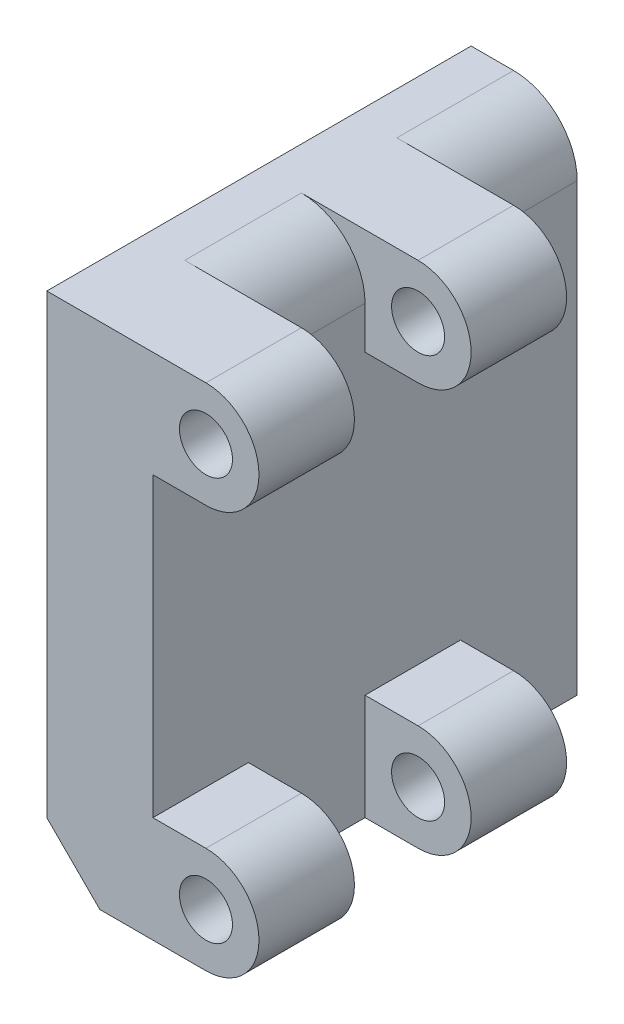
ISO-10303-21;
HEADER;
FILE_DESCRIPTION(('STEP AP214'),'2;1');
FILE_NAME('part.step','',(''),(''),'','','');
FILE_SCHEMA(('AUTOMOTIVE_DESIGN { 1 0 10303 214 1 1 1 1 }'));
ENDSEC;
DATA;
#1=APPLICATION_CONTEXT('core data for automotive mechanical design processes');
#2=APPLICATION_PROTOCOL_DEFINITION('international standard','automotive_design',2000,#1);
#3=PRODUCT_CONTEXT('',#1,'mechanical');
#4=PRODUCT('Part','Part','',(#3));
#5=PRODUCT_RELATED_PRODUCT_CATEGORY('part','',(#4));
#6=PRODUCT_DEFINITION_FORMATION('','',#4);
#7=PRODUCT_DEFINITION_CONTEXT('part definition',#1,'design');
#8=PRODUCT_DEFINITION('design','',#6,#7);
#9=PRODUCT_DEFINITION_SHAPE('','',#8);
#10=(LENGTH_UNIT() NAMED_UNIT(*) SI_UNIT(.MILLI.,.METRE.));
#11=(NAMED_UNIT(*) PLANE_ANGLE_UNIT() SI_UNIT($,.RADIAN.));
#12=(NAMED_UNIT(*) SI_UNIT($,.STERADIAN.) SOLID_ANGLE_UNIT());
#13=UNCERTAINTY_MEASURE_WITH_UNIT(LENGTH_MEASURE(1.E-05),#10,'distance_accuracy_value','');
#14=(GEOMETRIC_REPRESENTATION_CONTEXT(3) GLOBAL_UNCERTAINTY_ASSIGNED_CONTEXT((#13)) GLOBAL_UNIT_ASSIGNED_CONTEXT((#10,
#11,#12)) REPRESENTATION_CONTEXT('',''));
#15=CARTESIAN_POINT('',(0.,0.,0.));
#16=DIRECTION('',(0.,0.,1.));
#17=DIRECTION('',(1.,0.,0.));
#18=AXIS2_PLACEMENT_3D('',#15,#16,#17);
#19=CARTESIAN_POINT('',(10.,0.,0.));
#20=DIRECTION('',(-1.,0.,0.));
#21=DIRECTION('',(0.,0.,1.));
#22=AXIS2_PLACEMENT_3D('',#19,#20,#21);
#23=PLANE('',#22);
#24=DIRECTION('',(0.,1.,0.));
#25=VECTOR('',#24,1.);
#26=CARTESIAN_POINT('',(10.,-24.,-20.));
#27=LINE('',#26,#25);
#28=CARTESIAN_POINT('',(10.,-24.,-20.));
#29=VERTEX_POINT('',#28);
#30=CARTESIAN_POINT('',(10.,18.,-20.));
#31=VERTEX_POINT('',#30);
#32=EDGE_CURVE('E359',#29,#31,#27,.T.);
#33=ORIENTED_EDGE('',*,*,#32,.T.);
#34=DIRECTION('',(0.,0.,1.));
#35=VECTOR('',#34,1.);
#36=CARTESIAN_POINT('',(10.,18.,0.));
#37=LINE('',#36,#35);
#38=CARTESIAN_POINT('',(10.,18.,-9.));
#39=VERTEX_POINT('',#38);
#40=EDGE_CURVE('E411',#31,#39,#37,.T.);
#41=ORIENTED_EDGE('',*,*,#40,.T.);
#42=DIRECTION('',(0.,1.,0.));
#43=VECTOR('',#42,1.);
#44=CARTESIAN_POINT('',(10.,0.,-9.));
#45=LINE('',#44,#43);
#46=CARTESIAN_POINT('',(10.,14.,-9.));
#47=VERTEX_POINT('',#46);
#48=EDGE_CURVE('E279',#47,#39,#45,.T.);
#49=ORIENTED_EDGE('',*,*,#48,.F.);
#50=DIRECTION('',(0.,0.,1.));
#51=VECTOR('',#50,1.);
#52=CARTESIAN_POINT('',(10.,14.,0.));
#53=LINE('',#52,#51);
#54=CARTESIAN_POINT('',(10.,14.,0.));
#55=VERTEX_POINT('',#54);
#56=EDGE_CURVE('E399',#47,#55,#53,.T.);
#57=ORIENTED_EDGE('',*,*,#56,.T.);
#58=DIRECTION('',(0.,1.,0.));
#59=VECTOR('',#58,1.);
#60=CARTESIAN_POINT('',(10.,0.,0.));
#61=LINE('',#60,#59);
#62=CARTESIAN_POINT('',(10.,18.,0.));
#63=VERTEX_POINT('',#62);
#64=EDGE_CURVE('E272',#55,#63,#61,.T.);
#65=ORIENTED_EDGE('',*,*,#64,.T.);
#66=DIRECTION('',(0.,0.,1.));
#67=VECTOR('',#66,1.);
#68=CARTESIAN_POINT('',(10.,18.,0.));
#69=LINE('',#68,#67);
#70=CARTESIAN_POINT('',(10.,18.,11.));
#71=VERTEX_POINT('',#70);
#72=EDGE_CURVE('E407',#63,#71,#69,.T.);
#73=ORIENTED_EDGE('',*,*,#72,.T.);
#74=DIRECTION('',(0.,1.,0.));
#75=VECTOR('',#74,1.);
#76=CARTESIAN_POINT('',(10.,0.,11.));
#77=LINE('',#76,#75);
#78=CARTESIAN_POINT('',(10.,14.,11.));
#79=VERTEX_POINT('',#78);
#80=EDGE_CURVE('E351',#79,#71,#77,.T.);
#81=ORIENTED_EDGE('',*,*,#80,.F.);
#82=DIRECTION('',(0.,0.,1.));
#83=VECTOR('',#82,1.);
#84=CARTESIAN_POINT('',(10.,14.,0.));
#85=LINE('',#84,#83);
#86=CARTESIAN_POINT('',(10.,14.,20.));
#87=VERTEX_POINT('',#86);
#88=EDGE_CURVE('E392',#79,#87,#85,.T.);
#89=ORIENTED_EDGE('',*,*,#88,.T.);
#90=DIRECTION('',(0.,-1.,0.));
#91=VECTOR('',#90,1.);
#92=CARTESIAN_POINT('',(10.,-24.,20.));
#93=LINE('',#92,#91);
#94=CARTESIAN_POINT('',(10.,-14.,20.));
#95=VERTEX_POINT('',#94);
#96=EDGE_CURVE('E363',#87,#95,#93,.T.);
#97=ORIENTED_EDGE('',*,*,#96,.T.);
#98=DIRECTION('',(0.,0.,-1.));
#99=VECTOR('',#98,1.);
#100=CARTESIAN_POINT('',(10.,-14.,0.));
#101=LINE('',#100,#99);
#102=CARTESIAN_POINT('',(10.,-14.,11.));
#103=VERTEX_POINT('',#102);
#104=EDGE_CURVE('E396',#95,#103,#101,.T.);
#105=ORIENTED_EDGE('',*,*,#104,.T.);
#106=DIRECTION('',(0.,1.,0.));
#107=VECTOR('',#106,1.);
#108=CARTESIAN_POINT('',(10.,0.,11.));
#109=LINE('',#108,#107);
#110=CARTESIAN_POINT('',(10.,-24.,11.));
#111=VERTEX_POINT('',#110);
#112=EDGE_CURVE('E314',#111,#103,#109,.T.);
#113=ORIENTED_EDGE('',*,*,#112,.F.);
#114=DIRECTION('',(0.,0.,-1.));
#115=VECTOR('',#114,1.);
#116=CARTESIAN_POINT('',(10.,-24.,20.));
#117=LINE('',#116,#115);
#118=CARTESIAN_POINT('',(10.,-24.,0.));
#119=VERTEX_POINT('',#118);
#120=EDGE_CURVE('E367',#111,#119,#117,.T.);
#121=ORIENTED_EDGE('',*,*,#120,.T.);
#122=DIRECTION('',(0.,1.,0.));
#123=VECTOR('',#122,1.);
#124=CARTESIAN_POINT('',(10.,0.,0.));
#125=LINE('',#124,#123);
#126=CARTESIAN_POINT('',(10.,-14.,0.));
#127=VERTEX_POINT('',#126);
#128=EDGE_CURVE('E232',#119,#127,#125,.T.);
#129=ORIENTED_EDGE('',*,*,#128,.T.);
#130=DIRECTION('',(0.,0.,-1.));
#131=VECTOR('',#130,1.);
#132=CARTESIAN_POINT('',(10.,-14.,0.));
#133=LINE('',#132,#131);
#134=CARTESIAN_POINT('',(10.,-14.,-9.));
#135=VERTEX_POINT('',#134);
#136=EDGE_CURVE('E403',#127,#135,#133,.T.);
#137=ORIENTED_EDGE('',*,*,#136,.T.);
#138=DIRECTION('',(0.,1.,0.));
#139=VECTOR('',#138,1.);
#140=CARTESIAN_POINT('',(10.,0.,-9.));
#141=LINE('',#140,#139);
#142=CARTESIAN_POINT('',(10.,-24.,-9.));
#143=VERTEX_POINT('',#142);
#144=EDGE_CURVE('E237',#143,#135,#141,.T.);
#145=ORIENTED_EDGE('',*,*,#144,.F.);
#146=EDGE_CURVE('E197',#143,#29,#117,.T.);
#147=ORIENTED_EDGE('',*,*,#146,.T.);
#148=EDGE_LOOP('',(#33,#41,#49,#57,#65,#73,#81,#89,#97,#105,#113,#121,#129,#137,#145,#147));
#149=FACE_BOUND('',#148,.T.);
#150=ADVANCED_FACE('F45',(#149),#23,.F.);
#151=CARTESIAN_POINT('',(10.,-24.,-20.));
#152=DIRECTION('',(0.,0.,1.));
#153=DIRECTION('',(1.,0.,0.));
#154=AXIS2_PLACEMENT_3D('',#151,#152,#153);
#155=PLANE('',#154);
#156=DIRECTION('',(-1.,0.,0.));
#157=VECTOR('',#156,1.);
#158=CARTESIAN_POINT('',(10.,-24.,-20.));
#159=LINE('',#158,#157);
#160=CARTESIAN_POINT('',(5.,-24.,-20.));
#161=VERTEX_POINT('',#160);
#162=EDGE_CURVE('E371',#29,#161,#159,.T.);
#163=ORIENTED_EDGE('',*,*,#162,.T.);
#164=DIRECTION('',(-0.707106781186547,0.707106781186548,0.));
#165=VECTOR('',#164,1.);
#166=CARTESIAN_POINT('',(5.,-24.,-20.));
#167=LINE('',#166,#165);
#168=CARTESIAN_POINT('',(0.,-19.,-20.));
#169=VERTEX_POINT('',#168);
#170=EDGE_CURVE('E69',#161,#169,#167,.T.);
#171=ORIENTED_EDGE('',*,*,#170,.T.);
#172=DIRECTION('',(0.,1.,0.));
#173=VECTOR('',#172,1.);
#174=CARTESIAN_POINT('',(0.,-24.,-20.));
#175=LINE('',#174,#173);
#176=CARTESIAN_POINT('',(0.,24.,-20.));
#177=VERTEX_POINT('',#176);
#178=EDGE_CURVE('E358',#169,#177,#175,.T.);
#179=ORIENTED_EDGE('',*,*,#178,.T.);
#180=DIRECTION('',(-1.,0.,0.));
#181=VECTOR('',#180,1.);
#182=CARTESIAN_POINT('',(10.,24.,-20.));
#183=LINE('',#182,#181);
#184=CARTESIAN_POINT('',(4.,24.,-20.));
#185=VERTEX_POINT('',#184);
#186=EDGE_CURVE('E388',#185,#177,#183,.T.);
#187=ORIENTED_EDGE('',*,*,#186,.F.);
#188=CARTESIAN_POINT('',(4.,18.,-20.));
#189=DIRECTION('',(0.,0.,1.));
#190=DIRECTION('',(1.,0.,0.));
#191=AXIS2_PLACEMENT_3D('',#188,#189,#190);
#192=CIRCLE('',#191,6.);
#193=EDGE_CURVE('E422',#185,#31,#192,.F.);
#194=ORIENTED_EDGE('',*,*,#193,.T.);
#195=ORIENTED_EDGE('',*,*,#32,.F.);
#196=EDGE_LOOP('',(#163,#171,#179,#187,#194,#195));
#197=FACE_BOUND('',#196,.T.);
#198=ADVANCED_FACE('F447',(#197),#155,.F.);
#199=CARTESIAN_POINT('',(10.,24.,20.));
#200=DIRECTION('',(0.,-1.,0.));
#201=DIRECTION('',(0.,0.,-1.));
#202=AXIS2_PLACEMENT_3D('',#199,#200,#201);
#203=PLANE('',#202);
#204=DIRECTION('',(-1.,0.,0.));
#205=VECTOR('',#204,1.);
#206=CARTESIAN_POINT('',(5.,24.,-9.));
#207=LINE('',#206,#205);
#208=CARTESIAN_POINT('',(15.,24.,-9.));
#209=VERTEX_POINT('',#208);
#210=CARTESIAN_POINT('',(4.,24.,-9.));
#211=VERTEX_POINT('',#210);
#212=EDGE_CURVE('E257',#209,#211,#207,.T.);
#213=ORIENTED_EDGE('',*,*,#212,.T.);
#214=DIRECTION('',(0.,0.,1.));
#215=VECTOR('',#214,1.);
#216=CARTESIAN_POINT('',(4.,24.,20.));
#217=LINE('',#216,#215);
#218=EDGE_CURVE('E419',#211,#185,#217,.F.);
#219=ORIENTED_EDGE('',*,*,#218,.T.);
#220=ORIENTED_EDGE('',*,*,#186,.T.);
#221=DIRECTION('',(0.,0.,1.));
#222=VECTOR('',#221,1.);
#223=CARTESIAN_POINT('',(0.,24.,20.));
#224=LINE('',#223,#222);
#225=CARTESIAN_POINT('',(0.,24.,20.));
#226=VERTEX_POINT('',#225);
#227=EDGE_CURVE('E374',#177,#226,#224,.T.);
#228=ORIENTED_EDGE('',*,*,#227,.T.);
#229=DIRECTION('',(-1.,0.,0.));
#230=VECTOR('',#229,1.);
#231=CARTESIAN_POINT('',(10.,24.,20.));
#232=LINE('',#231,#230);
#233=CARTESIAN_POINT('',(15.,24.,20.));
#234=VERTEX_POINT('',#233);
#235=EDGE_CURVE('E385',#234,#226,#232,.T.);
#236=ORIENTED_EDGE('',*,*,#235,.F.);
#237=DIRECTION('',(0.,0.,1.));
#238=VECTOR('',#237,1.);
#239=CARTESIAN_POINT('',(15.,24.,11.));
#240=LINE('',#239,#238);
#241=CARTESIAN_POINT('',(15.,24.,11.));
#242=VERTEX_POINT('',#241);
#243=EDGE_CURVE('E347',#242,#234,#240,.T.);
#244=ORIENTED_EDGE('',*,*,#243,.F.);
#245=DIRECTION('',(-1.,0.,0.));
#246=VECTOR('',#245,1.);
#247=CARTESIAN_POINT('',(5.,24.,11.));
#248=LINE('',#247,#246);
#249=CARTESIAN_POINT('',(4.,24.,11.));
#250=VERTEX_POINT('',#249);
#251=EDGE_CURVE('E338',#242,#250,#248,.T.);
#252=ORIENTED_EDGE('',*,*,#251,.T.);
#253=DIRECTION('',(0.,0.,1.));
#254=VECTOR('',#253,1.);
#255=CARTESIAN_POINT('',(4.,24.,20.));
#256=LINE('',#255,#254);
#257=CARTESIAN_POINT('',(4.,24.,0.));
#258=VERTEX_POINT('',#257);
#259=EDGE_CURVE('E415',#250,#258,#256,.F.);
#260=ORIENTED_EDGE('',*,*,#259,.T.);
#261=DIRECTION('',(-1.,0.,0.));
#262=VECTOR('',#261,1.);
#263=CARTESIAN_POINT('',(5.,24.,0.));
#264=LINE('',#263,#262);
#265=CARTESIAN_POINT('',(15.,24.,0.));
#266=VERTEX_POINT('',#265);
#267=EDGE_CURVE('E253',#266,#258,#264,.T.);
#268=ORIENTED_EDGE('',*,*,#267,.F.);
#269=DIRECTION('',(0.,0.,1.));
#270=VECTOR('',#269,1.);
#271=CARTESIAN_POINT('',(15.,24.,-9.));
#272=LINE('',#271,#270);
#273=EDGE_CURVE('E269',#209,#266,#272,.T.);
#274=ORIENTED_EDGE('',*,*,#273,.F.);
#275=EDGE_LOOP('',(#213,#219,#220,#228,#236,#244,#252,#260,#268,#274));
#276=FACE_BOUND('',#275,.T.);
#277=ADVANCED_FACE('F470',(#276),#203,.F.);
#278=CARTESIAN_POINT('',(10.,-24.,20.));
#279=DIRECTION('',(0.,0.,-1.));
#280=DIRECTION('',(-1.,0.,0.));
#281=AXIS2_PLACEMENT_3D('',#278,#279,#280);
#282=PLANE('',#281);
#283=DIRECTION('',(0.,-1.,0.));
#284=VECTOR('',#283,1.);
#285=CARTESIAN_POINT('',(0.,-24.,20.));
#286=LINE('',#285,#284);
#287=CARTESIAN_POINT('',(0.,-19.,20.));
#288=VERTEX_POINT('',#287);
#289=EDGE_CURVE('E364',#226,#288,#286,.T.);
#290=ORIENTED_EDGE('',*,*,#289,.T.);
#291=DIRECTION('',(0.707106781186547,-0.707106781186548,0.));
#292=VECTOR('',#291,1.);
#293=CARTESIAN_POINT('',(5.,-24.,20.));
#294=LINE('',#293,#292);
#295=CARTESIAN_POINT('',(5.,-24.,20.));
#296=VERTEX_POINT('',#295);
#297=EDGE_CURVE('E11',#288,#296,#294,.T.);
#298=ORIENTED_EDGE('',*,*,#297,.T.);
#299=DIRECTION('',(-1.,0.,0.));
#300=VECTOR('',#299,1.);
#301=CARTESIAN_POINT('',(10.,-24.,20.));
#302=LINE('',#301,#300);
#303=CARTESIAN_POINT('',(15.,-24.,20.));
#304=VERTEX_POINT('',#303);
#305=EDGE_CURVE('E382',#304,#296,#302,.T.);
#306=ORIENTED_EDGE('',*,*,#305,.F.);
#307=CARTESIAN_POINT('',(15.,-19.,20.));
#308=DIRECTION('',(0.,0.,1.));
#309=DIRECTION('',(1.,0.,0.));
#310=AXIS2_PLACEMENT_3D('',#307,#308,#309);
#311=CIRCLE('',#310,5.);
#312=CARTESIAN_POINT('',(15.,-14.,20.));
#313=VERTEX_POINT('',#312);
#314=EDGE_CURVE('E295',#304,#313,#311,.T.);
#315=ORIENTED_EDGE('',*,*,#314,.T.);
#316=DIRECTION('',(-1.,0.,0.));
#317=VECTOR('',#316,1.);
#318=CARTESIAN_POINT('',(5.,-14.,20.));
#319=LINE('',#318,#317);
#320=EDGE_CURVE('E291',#313,#95,#319,.T.);
#321=ORIENTED_EDGE('',*,*,#320,.T.);
#322=ORIENTED_EDGE('',*,*,#96,.F.);
#323=DIRECTION('',(1.,0.,0.));
#324=VECTOR('',#323,1.);
#325=CARTESIAN_POINT('',(5.,14.,20.));
#326=LINE('',#325,#324);
#327=CARTESIAN_POINT('',(15.,14.,20.));
#328=VERTEX_POINT('',#327);
#329=EDGE_CURVE('E326',#87,#328,#326,.T.);
#330=ORIENTED_EDGE('',*,*,#329,.T.);
#331=CARTESIAN_POINT('',(15.,19.,20.));
#332=DIRECTION('',(0.,0.,1.));
#333=DIRECTION('',(1.,0.,0.));
#334=AXIS2_PLACEMENT_3D('',#331,#332,#333);
#335=CIRCLE('',#334,5.);
#336=EDGE_CURVE('E334',#328,#234,#335,.T.);
#337=ORIENTED_EDGE('',*,*,#336,.T.);
#338=ORIENTED_EDGE('',*,*,#235,.T.);
#339=EDGE_LOOP('',(#290,#298,#306,#315,#321,#322,#330,#337,#338));
#340=FACE_BOUND('',#339,.T.);
#341=CARTESIAN_POINT('',(15.,19.,20.));
#342=DIRECTION('',(0.,0.,1.));
#343=DIRECTION('',(1.,0.,0.));
#344=AXIS2_PLACEMENT_3D('',#341,#342,#343);
#345=CIRCLE('',#344,2.5);
#346=CARTESIAN_POINT('',(17.5,19.,20.));
#347=VERTEX_POINT('',#346);
#348=EDGE_CURVE('E321',#347,#347,#345,.T.);
#349=ORIENTED_EDGE('',*,*,#348,.F.);
#350=EDGE_LOOP('',(#349));
#351=FACE_BOUND('',#350,.T.);
#352=CARTESIAN_POINT('',(15.,-19.,20.));
#353=DIRECTION('',(0.,0.,1.));
#354=DIRECTION('',(1.,0.,0.));
#355=AXIS2_PLACEMENT_3D('',#352,#353,#354);
#356=CIRCLE('',#355,2.5);
#357=CARTESIAN_POINT('',(17.5,-19.,20.));
#358=VERTEX_POINT('',#357);
#359=EDGE_CURVE('E310',#358,#358,#356,.T.);
#360=ORIENTED_EDGE('',*,*,#359,.F.);
#361=EDGE_LOOP('',(#360));
#362=FACE_BOUND('',#361,.T.);
#363=ADVANCED_FACE('F490',(#340,#351,#362),#282,.F.);
#364=CARTESIAN_POINT('',(10.,-24.,20.));
#365=DIRECTION('',(0.,1.,0.));
#366=DIRECTION('',(0.,0.,1.));
#367=AXIS2_PLACEMENT_3D('',#364,#365,#366);
#368=PLANE('',#367);
#369=ORIENTED_EDGE('',*,*,#305,.T.);
#370=DIRECTION('',(0.,0.,-1.));
#371=VECTOR('',#370,1.);
#372=CARTESIAN_POINT('',(5.,-24.,-20.));
#373=LINE('',#372,#371);
#374=EDGE_CURVE('E436',#296,#161,#373,.T.);
#375=ORIENTED_EDGE('',*,*,#374,.T.);
#376=ORIENTED_EDGE('',*,*,#162,.F.);
#377=ORIENTED_EDGE('',*,*,#146,.F.);
#378=DIRECTION('',(1.,0.,0.));
#379=VECTOR('',#378,1.);
#380=CARTESIAN_POINT('',(5.,-24.,-9.));
#381=LINE('',#380,#379);
#382=CARTESIAN_POINT('',(15.,-24.,-9.));
#383=VERTEX_POINT('',#382);
#384=EDGE_CURVE('E189',#143,#383,#381,.T.);
#385=ORIENTED_EDGE('',*,*,#384,.T.);
#386=DIRECTION('',(0.,0.,1.));
#387=VECTOR('',#386,1.);
#388=CARTESIAN_POINT('',(15.,-24.,-9.));
#389=LINE('',#388,#387);
#390=CARTESIAN_POINT('',(15.,-24.,0.));
#391=VERTEX_POINT('',#390);
#392=EDGE_CURVE('E194',#383,#391,#389,.T.);
#393=ORIENTED_EDGE('',*,*,#392,.T.);
#394=DIRECTION('',(1.,0.,0.));
#395=VECTOR('',#394,1.);
#396=CARTESIAN_POINT('',(5.,-24.,0.));
#397=LINE('',#396,#395);
#398=EDGE_CURVE('E223',#119,#391,#397,.T.);
#399=ORIENTED_EDGE('',*,*,#398,.F.);
#400=ORIENTED_EDGE('',*,*,#120,.F.);
#401=DIRECTION('',(1.,0.,0.));
#402=VECTOR('',#401,1.);
#403=CARTESIAN_POINT('',(5.,-24.,11.));
#404=LINE('',#403,#402);
#405=CARTESIAN_POINT('',(15.,-24.,11.));
#406=VERTEX_POINT('',#405);
#407=EDGE_CURVE('E296',#111,#406,#404,.T.);
#408=ORIENTED_EDGE('',*,*,#407,.T.);
#409=DIRECTION('',(0.,0.,1.));
#410=VECTOR('',#409,1.);
#411=CARTESIAN_POINT('',(15.,-24.,11.));
#412=LINE('',#411,#410);
#413=EDGE_CURVE('E284',#406,#304,#412,.T.);
#414=ORIENTED_EDGE('',*,*,#413,.T.);
#415=EDGE_LOOP('',(#369,#375,#376,#377,#385,#393,#399,#400,#408,#414));
#416=FACE_BOUND('',#415,.T.);
#417=ADVANCED_FACE('F192',(#416),#368,.F.);
#418=CARTESIAN_POINT('',(0.,0.,0.));
#419=DIRECTION('',(-1.,0.,0.));
#420=DIRECTION('',(0.,0.,1.));
#421=AXIS2_PLACEMENT_3D('',#418,#419,#420);
#422=PLANE('',#421);
#423=ORIENTED_EDGE('',*,*,#178,.F.);
#424=DIRECTION('',(0.,0.,1.));
#425=VECTOR('',#424,1.);
#426=CARTESIAN_POINT('',(0.,-19.,20.));
#427=LINE('',#426,#425);
#428=EDGE_CURVE('E55',#169,#288,#427,.T.);
#429=ORIENTED_EDGE('',*,*,#428,.T.);
#430=ORIENTED_EDGE('',*,*,#289,.F.);
#431=ORIENTED_EDGE('',*,*,#227,.F.);
#432=EDGE_LOOP('',(#423,#429,#430,#431));
#433=FACE_BOUND('',#432,.T.);
#434=ADVANCED_FACE('F531',(#433),#422,.T.);
#435=CARTESIAN_POINT('',(5.,14.,11.));
#436=DIRECTION('',(0.,-1.,0.));
#437=DIRECTION('',(0.,0.,-1.));
#438=AXIS2_PLACEMENT_3D('',#435,#436,#437);
#439=PLANE('',#438);
#440=ORIENTED_EDGE('',*,*,#88,.F.);
#441=DIRECTION('',(1.,0.,0.));
#442=VECTOR('',#441,1.);
#443=CARTESIAN_POINT('',(5.,14.,11.));
#444=LINE('',#443,#442);
#445=CARTESIAN_POINT('',(15.,14.,11.));
#446=VERTEX_POINT('',#445);
#447=EDGE_CURVE('E330',#79,#446,#444,.T.);
#448=ORIENTED_EDGE('',*,*,#447,.T.);
#449=DIRECTION('',(0.,0.,1.));
#450=VECTOR('',#449,1.);
#451=CARTESIAN_POINT('',(15.,14.,11.));
#452=LINE('',#451,#450);
#453=EDGE_CURVE('E341',#446,#328,#452,.T.);
#454=ORIENTED_EDGE('',*,*,#453,.T.);
#455=ORIENTED_EDGE('',*,*,#329,.F.);
#456=EDGE_LOOP('',(#440,#448,#454,#455));
#457=FACE_BOUND('',#456,.T.);
#458=ADVANCED_FACE('F484',(#457),#439,.T.);
#459=CARTESIAN_POINT('',(5.,19.,11.));
#460=DIRECTION('',(0.,0.,1.));
#461=DIRECTION('',(1.,0.,0.));
#462=AXIS2_PLACEMENT_3D('',#459,#460,#461);
#463=PLANE('',#462);
#464=CARTESIAN_POINT('',(15.,19.,11.));
#465=DIRECTION('',(0.,0.,1.));
#466=DIRECTION('',(1.,0.,0.));
#467=AXIS2_PLACEMENT_3D('',#464,#465,#466);
#468=CIRCLE('',#467,2.5);
#469=CARTESIAN_POINT('',(17.5,19.,11.));
#470=VERTEX_POINT('',#469);
#471=EDGE_CURVE('E322',#470,#470,#468,.T.);
#472=ORIENTED_EDGE('',*,*,#471,.T.);
#473=EDGE_LOOP('',(#472));
#474=FACE_BOUND('',#473,.T.);
#475=ORIENTED_EDGE('',*,*,#447,.F.);
#476=ORIENTED_EDGE('',*,*,#80,.T.);
#477=CARTESIAN_POINT('',(4.,18.,11.));
#478=DIRECTION('',(0.,0.,1.));
#479=DIRECTION('',(1.,0.,0.));
#480=AXIS2_PLACEMENT_3D('',#477,#478,#479);
#481=CIRCLE('',#480,6.);
#482=EDGE_CURVE('E429',#71,#250,#481,.T.);
#483=ORIENTED_EDGE('',*,*,#482,.T.);
#484=ORIENTED_EDGE('',*,*,#251,.F.);
#485=CARTESIAN_POINT('',(15.,19.,11.));
#486=DIRECTION('',(0.,0.,1.));
#487=DIRECTION('',(1.,0.,0.));
#488=AXIS2_PLACEMENT_3D('',#485,#486,#487);
#489=CIRCLE('',#488,5.);
#490=EDGE_CURVE('E333',#446,#242,#489,.T.);
#491=ORIENTED_EDGE('',*,*,#490,.F.);
#492=EDGE_LOOP('',(#475,#476,#483,#484,#491));
#493=FACE_BOUND('',#492,.T.);
#494=ADVANCED_FACE('F480',(#474,#493),#463,.F.);
#495=CARTESIAN_POINT('',(15.,19.,11.));
#496=DIRECTION('',(0.,0.,1.));
#497=DIRECTION('',(1.,0.,0.));
#498=AXIS2_PLACEMENT_3D('',#495,#496,#497);
#499=CYLINDRICAL_SURFACE('',#498,5.);
#500=ORIENTED_EDGE('',*,*,#336,.F.);
#501=ORIENTED_EDGE('',*,*,#453,.F.);
#502=ORIENTED_EDGE('',*,*,#490,.T.);
#503=ORIENTED_EDGE('',*,*,#243,.T.);
#504=EDGE_LOOP('',(#500,#501,#502,#503));
#505=FACE_BOUND('',#504,.T.);
#506=ADVANCED_FACE('F488',(#505),#499,.T.);
#507=CARTESIAN_POINT('',(15.,19.,11.));
#508=DIRECTION('',(0.,0.,1.));
#509=DIRECTION('',(1.,0.,0.));
#510=AXIS2_PLACEMENT_3D('',#507,#508,#509);
#511=CYLINDRICAL_SURFACE('',#510,2.5);
#512=ORIENTED_EDGE('',*,*,#471,.F.);
#513=EDGE_LOOP('',(#512));
#514=FACE_BOUND('',#513,.T.);
#515=ORIENTED_EDGE('',*,*,#348,.T.);
#516=EDGE_LOOP('',(#515));
#517=FACE_BOUND('',#516,.T.);
#518=ADVANCED_FACE('F568',(#514,#517),#511,.F.);
#519=CARTESIAN_POINT('',(5.,-14.,11.));
#520=DIRECTION('',(0.,1.,0.));
#521=DIRECTION('',(0.,0.,1.));
#522=AXIS2_PLACEMENT_3D('',#519,#520,#521);
#523=PLANE('',#522);
#524=ORIENTED_EDGE('',*,*,#104,.F.);
#525=ORIENTED_EDGE('',*,*,#320,.F.);
#526=DIRECTION('',(0.,0.,1.));
#527=VECTOR('',#526,1.);
#528=CARTESIAN_POINT('',(15.,-14.,11.));
#529=LINE('',#528,#527);
#530=CARTESIAN_POINT('',(15.,-14.,11.));
#531=VERTEX_POINT('',#530);
#532=EDGE_CURVE('E283',#531,#313,#529,.T.);
#533=ORIENTED_EDGE('',*,*,#532,.F.);
#534=DIRECTION('',(-1.,0.,0.));
#535=VECTOR('',#534,1.);
#536=CARTESIAN_POINT('',(5.,-14.,11.));
#537=LINE('',#536,#535);
#538=EDGE_CURVE('E288',#531,#103,#537,.T.);
#539=ORIENTED_EDGE('',*,*,#538,.T.);
#540=EDGE_LOOP('',(#524,#525,#533,#539));
#541=FACE_BOUND('',#540,.T.);
#542=ADVANCED_FACE('F495',(#541),#523,.T.);
#543=CARTESIAN_POINT('',(5.,-19.,11.));
#544=DIRECTION('',(0.,0.,1.));
#545=DIRECTION('',(1.,0.,0.));
#546=AXIS2_PLACEMENT_3D('',#543,#544,#545);
#547=PLANE('',#546);
#548=CARTESIAN_POINT('',(15.,-19.,11.));
#549=DIRECTION('',(0.,0.,1.));
#550=DIRECTION('',(1.,0.,0.));
#551=AXIS2_PLACEMENT_3D('',#548,#549,#550);
#552=CIRCLE('',#551,2.5);
#553=CARTESIAN_POINT('',(17.5,-19.,11.));
#554=VERTEX_POINT('',#553);
#555=EDGE_CURVE('E300',#554,#554,#552,.T.);
#556=ORIENTED_EDGE('',*,*,#555,.T.);
#557=EDGE_LOOP('',(#556));
#558=FACE_BOUND('',#557,.T.);
#559=ORIENTED_EDGE('',*,*,#407,.F.);
#560=ORIENTED_EDGE('',*,*,#112,.T.);
#561=ORIENTED_EDGE('',*,*,#538,.F.);
#562=CARTESIAN_POINT('',(15.,-19.,11.));
#563=DIRECTION('',(0.,0.,1.));
#564=DIRECTION('',(1.,0.,0.));
#565=AXIS2_PLACEMENT_3D('',#562,#563,#564);
#566=CIRCLE('',#565,5.);
#567=EDGE_CURVE('E304',#406,#531,#566,.T.);
#568=ORIENTED_EDGE('',*,*,#567,.F.);
#569=EDGE_LOOP('',(#559,#560,#561,#568));
#570=FACE_BOUND('',#569,.T.);
#571=ADVANCED_FACE('F500',(#558,#570),#547,.F.);
#572=CARTESIAN_POINT('',(15.,-19.,11.));
#573=DIRECTION('',(0.,0.,1.));
#574=DIRECTION('',(1.,0.,0.));
#575=AXIS2_PLACEMENT_3D('',#572,#573,#574);
#576=CYLINDRICAL_SURFACE('',#575,5.);
#577=ORIENTED_EDGE('',*,*,#314,.F.);
#578=ORIENTED_EDGE('',*,*,#413,.F.);
#579=ORIENTED_EDGE('',*,*,#567,.T.);
#580=ORIENTED_EDGE('',*,*,#532,.T.);
#581=EDGE_LOOP('',(#577,#578,#579,#580));
#582=FACE_BOUND('',#581,.T.);
#583=ADVANCED_FACE('F552',(#582),#576,.T.);
#584=CARTESIAN_POINT('',(15.,-19.,11.));
#585=DIRECTION('',(0.,0.,1.));
#586=DIRECTION('',(1.,0.,0.));
#587=AXIS2_PLACEMENT_3D('',#584,#585,#586);
#588=CYLINDRICAL_SURFACE('',#587,2.5);
#589=ORIENTED_EDGE('',*,*,#555,.F.);
#590=EDGE_LOOP('',(#589));
#591=FACE_BOUND('',#590,.T.);
#592=ORIENTED_EDGE('',*,*,#359,.T.);
#593=EDGE_LOOP('',(#592));
#594=FACE_BOUND('',#593,.T.);
#595=ADVANCED_FACE('F554',(#591,#594),#588,.F.);
#596=CARTESIAN_POINT('',(5.,14.,-9.));
#597=DIRECTION('',(0.,-1.,0.));
#598=DIRECTION('',(0.,0.,-1.));
#599=AXIS2_PLACEMENT_3D('',#596,#597,#598);
#600=PLANE('',#599);
#601=ORIENTED_EDGE('',*,*,#56,.F.);
#602=DIRECTION('',(1.,0.,0.));
#603=VECTOR('',#602,1.);
#604=CARTESIAN_POINT('',(5.,14.,-9.));
#605=LINE('',#604,#603);
#606=CARTESIAN_POINT('',(15.,14.,-9.));
#607=VERTEX_POINT('',#606);
#608=EDGE_CURVE('E249',#47,#607,#605,.T.);
#609=ORIENTED_EDGE('',*,*,#608,.T.);
#610=DIRECTION('',(0.,0.,1.));
#611=VECTOR('',#610,1.);
#612=CARTESIAN_POINT('',(15.,14.,-9.));
#613=LINE('',#612,#611);
#614=CARTESIAN_POINT('',(15.,14.,0.));
#615=VERTEX_POINT('',#614);
#616=EDGE_CURVE('E260',#607,#615,#613,.T.);
#617=ORIENTED_EDGE('',*,*,#616,.T.);
#618=DIRECTION('',(1.,0.,0.));
#619=VECTOR('',#618,1.);
#620=CARTESIAN_POINT('',(5.,14.,0.));
#621=LINE('',#620,#619);
#622=EDGE_CURVE('E245',#55,#615,#621,.T.);
#623=ORIENTED_EDGE('',*,*,#622,.F.);
#624=EDGE_LOOP('',(#601,#609,#617,#623));
#625=FACE_BOUND('',#624,.T.);
#626=ADVANCED_FACE('F461',(#625),#600,.T.);
#627=CARTESIAN_POINT('',(5.,19.,-9.));
#628=DIRECTION('',(0.,0.,1.));
#629=DIRECTION('',(1.,0.,0.));
#630=AXIS2_PLACEMENT_3D('',#627,#628,#629);
#631=PLANE('',#630);
#632=CARTESIAN_POINT('',(15.,19.,-9.));
#633=DIRECTION('',(0.,0.,1.));
#634=DIRECTION('',(1.,0.,0.));
#635=AXIS2_PLACEMENT_3D('',#632,#633,#634);
#636=CIRCLE('',#635,2.5);
#637=CARTESIAN_POINT('',(17.5,19.,-9.));
#638=VERTEX_POINT('',#637);
#639=EDGE_CURVE('E241',#638,#638,#636,.T.);
#640=ORIENTED_EDGE('',*,*,#639,.T.);
#641=EDGE_LOOP('',(#640));
#642=FACE_BOUND('',#641,.T.);
#643=ORIENTED_EDGE('',*,*,#608,.F.);
#644=ORIENTED_EDGE('',*,*,#48,.T.);
#645=CARTESIAN_POINT('',(4.,18.,-9.));
#646=DIRECTION('',(0.,0.,1.));
#647=DIRECTION('',(1.,0.,0.));
#648=AXIS2_PLACEMENT_3D('',#645,#646,#647);
#649=CIRCLE('',#648,6.);
#650=EDGE_CURVE('E425',#39,#211,#649,.T.);
#651=ORIENTED_EDGE('',*,*,#650,.T.);
#652=ORIENTED_EDGE('',*,*,#212,.F.);
#653=CARTESIAN_POINT('',(15.,19.,-9.));
#654=DIRECTION('',(0.,0.,1.));
#655=DIRECTION('',(1.,0.,0.));
#656=AXIS2_PLACEMENT_3D('',#653,#654,#655);
#657=CIRCLE('',#656,5.);
#658=EDGE_CURVE('E252',#607,#209,#657,.T.);
#659=ORIENTED_EDGE('',*,*,#658,.F.);
#660=EDGE_LOOP('',(#643,#644,#651,#652,#659));
#661=FACE_BOUND('',#660,.T.);
#662=ADVANCED_FACE('F456',(#642,#661),#631,.F.);
#663=CARTESIAN_POINT('',(5.,19.,0.));
#664=DIRECTION('',(0.,0.,1.));
#665=DIRECTION('',(1.,0.,0.));
#666=AXIS2_PLACEMENT_3D('',#663,#664,#665);
#667=PLANE('',#666);
#668=CARTESIAN_POINT('',(15.,19.,0.));
#669=DIRECTION('',(0.,0.,1.));
#670=DIRECTION('',(1.,0.,0.));
#671=AXIS2_PLACEMENT_3D('',#668,#669,#670);
#672=CIRCLE('',#671,2.5);
#673=CARTESIAN_POINT('',(17.5,19.,0.));
#674=VERTEX_POINT('',#673);
#675=EDGE_CURVE('E240',#674,#674,#672,.T.);
#676=ORIENTED_EDGE('',*,*,#675,.F.);
#677=EDGE_LOOP('',(#676));
#678=FACE_BOUND('',#677,.T.);
#679=ORIENTED_EDGE('',*,*,#64,.F.);
#680=ORIENTED_EDGE('',*,*,#622,.T.);
#681=CARTESIAN_POINT('',(15.,19.,0.));
#682=DIRECTION('',(0.,0.,1.));
#683=DIRECTION('',(1.,0.,0.));
#684=AXIS2_PLACEMENT_3D('',#681,#682,#683);
#685=CIRCLE('',#684,5.);
#686=EDGE_CURVE('E263',#615,#266,#685,.T.);
#687=ORIENTED_EDGE('',*,*,#686,.T.);
#688=ORIENTED_EDGE('',*,*,#267,.T.);
#689=CARTESIAN_POINT('',(4.,18.,0.));
#690=DIRECTION('',(0.,0.,1.));
#691=DIRECTION('',(1.,0.,0.));
#692=AXIS2_PLACEMENT_3D('',#689,#690,#691);
#693=CIRCLE('',#692,6.);
#694=EDGE_CURVE('E433',#258,#63,#693,.F.);
#695=ORIENTED_EDGE('',*,*,#694,.T.);
#696=EDGE_LOOP('',(#679,#680,#687,#688,#695));
#697=FACE_BOUND('',#696,.T.);
#698=ADVANCED_FACE('F468',(#678,#697),#667,.T.);
#699=CARTESIAN_POINT('',(15.,19.,-9.));
#700=DIRECTION('',(0.,0.,1.));
#701=DIRECTION('',(1.,0.,0.));
#702=AXIS2_PLACEMENT_3D('',#699,#700,#701);
#703=CYLINDRICAL_SURFACE('',#702,5.);
#704=ORIENTED_EDGE('',*,*,#686,.F.);
#705=ORIENTED_EDGE('',*,*,#616,.F.);
#706=ORIENTED_EDGE('',*,*,#658,.T.);
#707=ORIENTED_EDGE('',*,*,#273,.T.);
#708=EDGE_LOOP('',(#704,#705,#706,#707));
#709=FACE_BOUND('',#708,.T.);
#710=ADVANCED_FACE('F465',(#709),#703,.T.);
#711=CARTESIAN_POINT('',(15.,19.,-9.));
#712=DIRECTION('',(0.,0.,1.));
#713=DIRECTION('',(1.,0.,0.));
#714=AXIS2_PLACEMENT_3D('',#711,#712,#713);
#715=CYLINDRICAL_SURFACE('',#714,2.5);
#716=ORIENTED_EDGE('',*,*,#639,.F.);
#717=EDGE_LOOP('',(#716));
#718=FACE_BOUND('',#717,.T.);
#719=ORIENTED_EDGE('',*,*,#675,.T.);
#720=EDGE_LOOP('',(#719));
#721=FACE_BOUND('',#720,.T.);
#722=ADVANCED_FACE('F510',(#718,#721),#715,.F.);
#723=CARTESIAN_POINT('',(5.,-14.,-9.));
#724=DIRECTION('',(0.,1.,0.));
#725=DIRECTION('',(0.,0.,1.));
#726=AXIS2_PLACEMENT_3D('',#723,#724,#725);
#727=PLANE('',#726);
#728=ORIENTED_EDGE('',*,*,#136,.F.);
#729=DIRECTION('',(-1.,0.,0.));
#730=VECTOR('',#729,1.);
#731=CARTESIAN_POINT('',(5.,-14.,0.));
#732=LINE('',#731,#730);
#733=CARTESIAN_POINT('',(15.,-14.,0.));
#734=VERTEX_POINT('',#733);
#735=EDGE_CURVE('E203',#734,#127,#732,.T.);
#736=ORIENTED_EDGE('',*,*,#735,.F.);
#737=DIRECTION('',(0.,0.,1.));
#738=VECTOR('',#737,1.);
#739=CARTESIAN_POINT('',(15.,-14.,-9.));
#740=LINE('',#739,#738);
#741=CARTESIAN_POINT('',(15.,-14.,-9.));
#742=VERTEX_POINT('',#741);
#743=EDGE_CURVE('E212',#742,#734,#740,.T.);
#744=ORIENTED_EDGE('',*,*,#743,.F.);
#745=DIRECTION('',(-1.,0.,0.));
#746=VECTOR('',#745,1.);
#747=CARTESIAN_POINT('',(5.,-14.,-9.));
#748=LINE('',#747,#746);
#749=EDGE_CURVE('E213',#742,#135,#748,.T.);
#750=ORIENTED_EDGE('',*,*,#749,.T.);
#751=EDGE_LOOP('',(#728,#736,#744,#750));
#752=FACE_BOUND('',#751,.T.);
#753=ADVANCED_FACE('F508',(#752),#727,.T.);
#754=CARTESIAN_POINT('',(5.,-19.,-9.));
#755=DIRECTION('',(0.,0.,1.));
#756=DIRECTION('',(1.,0.,0.));
#757=AXIS2_PLACEMENT_3D('',#754,#755,#756);
#758=PLANE('',#757);
#759=CARTESIAN_POINT('',(15.,-19.,-9.));
#760=DIRECTION('',(0.,0.,1.));
#761=DIRECTION('',(1.,0.,0.));
#762=AXIS2_PLACEMENT_3D('',#759,#760,#761);
#763=CIRCLE('',#762,2.5);
#764=CARTESIAN_POINT('',(17.5,-19.,-9.));
#765=VERTEX_POINT('',#764);
#766=EDGE_CURVE('E226',#765,#765,#763,.T.);
#767=ORIENTED_EDGE('',*,*,#766,.T.);
#768=EDGE_LOOP('',(#767));
#769=FACE_BOUND('',#768,.T.);
#770=ORIENTED_EDGE('',*,*,#384,.F.);
#771=ORIENTED_EDGE('',*,*,#144,.T.);
#772=ORIENTED_EDGE('',*,*,#749,.F.);
#773=CARTESIAN_POINT('',(15.,-19.,-9.));
#774=DIRECTION('',(0.,0.,1.));
#775=DIRECTION('',(1.,0.,0.));
#776=AXIS2_PLACEMENT_3D('',#773,#774,#775);
#777=CIRCLE('',#776,5.);
#778=EDGE_CURVE('E202',#383,#742,#777,.T.);
#779=ORIENTED_EDGE('',*,*,#778,.F.);
#780=EDGE_LOOP('',(#770,#771,#772,#779));
#781=FACE_BOUND('',#780,.T.);
#782=ADVANCED_FACE('F215',(#769,#781),#758,.F.);
#783=CARTESIAN_POINT('',(5.,-19.,0.));
#784=DIRECTION('',(0.,0.,1.));
#785=DIRECTION('',(1.,0.,0.));
#786=AXIS2_PLACEMENT_3D('',#783,#784,#785);
#787=PLANE('',#786);
#788=CARTESIAN_POINT('',(15.,-19.,0.));
#789=DIRECTION('',(0.,0.,1.));
#790=DIRECTION('',(1.,0.,0.));
#791=AXIS2_PLACEMENT_3D('',#788,#789,#790);
#792=CIRCLE('',#791,2.5);
#793=CARTESIAN_POINT('',(17.5,-19.,0.));
#794=VERTEX_POINT('',#793);
#795=EDGE_CURVE('E823',#794,#794,#792,.T.);
#796=ORIENTED_EDGE('',*,*,#795,.F.);
#797=EDGE_LOOP('',(#796));
#798=FACE_BOUND('',#797,.T.);
#799=ORIENTED_EDGE('',*,*,#128,.F.);
#800=ORIENTED_EDGE('',*,*,#398,.T.);
#801=CARTESIAN_POINT('',(15.,-19.,0.));
#802=DIRECTION('',(0.,0.,1.));
#803=DIRECTION('',(1.,0.,0.));
#804=AXIS2_PLACEMENT_3D('',#801,#802,#803);
#805=CIRCLE('',#804,5.);
#806=EDGE_CURVE('E210',#391,#734,#805,.T.);
#807=ORIENTED_EDGE('',*,*,#806,.T.);
#808=ORIENTED_EDGE('',*,*,#735,.T.);
#809=EDGE_LOOP('',(#799,#800,#807,#808));
#810=FACE_BOUND('',#809,.T.);
#811=ADVANCED_FACE('F504',(#798,#810),#787,.T.);
#812=CARTESIAN_POINT('',(15.,-19.,-9.));
#813=DIRECTION('',(0.,0.,1.));
#814=DIRECTION('',(1.,0.,0.));
#815=AXIS2_PLACEMENT_3D('',#812,#813,#814);
#816=CYLINDRICAL_SURFACE('',#815,5.);
#817=ORIENTED_EDGE('',*,*,#806,.F.);
#818=ORIENTED_EDGE('',*,*,#392,.F.);
#819=ORIENTED_EDGE('',*,*,#778,.T.);
#820=ORIENTED_EDGE('',*,*,#743,.T.);
#821=EDGE_LOOP('',(#817,#818,#819,#820));
#822=FACE_BOUND('',#821,.T.);
#823=ADVANCED_FACE('F207',(#822),#816,.T.);
#824=CARTESIAN_POINT('',(15.,-19.,-9.));
#825=DIRECTION('',(0.,0.,1.));
#826=DIRECTION('',(1.,0.,0.));
#827=AXIS2_PLACEMENT_3D('',#824,#825,#826);
#828=CYLINDRICAL_SURFACE('',#827,2.5);
#829=ORIENTED_EDGE('',*,*,#766,.F.);
#830=EDGE_LOOP('',(#829));
#831=FACE_BOUND('',#830,.T.);
#832=ORIENTED_EDGE('',*,*,#795,.T.);
#833=EDGE_LOOP('',(#832));
#834=FACE_BOUND('',#833,.T.);
#835=ADVANCED_FACE('F541',(#831,#834),#828,.F.);
#836=CARTESIAN_POINT('',(4.,18.,0.));
#837=DIRECTION('',(0.,0.,1.));
#838=DIRECTION('',(1.,0.,0.));
#839=AXIS2_PLACEMENT_3D('',#836,#837,#838);
#840=CYLINDRICAL_SURFACE('',#839,6.);
#841=ORIENTED_EDGE('',*,*,#193,.F.);
#842=ORIENTED_EDGE('',*,*,#218,.F.);
#843=ORIENTED_EDGE('',*,*,#650,.F.);
#844=ORIENTED_EDGE('',*,*,#40,.F.);
#845=EDGE_LOOP('',(#841,#842,#843,#844));
#846=FACE_BOUND('',#845,.T.);
#847=ADVANCED_FACE('F452',(#846),#840,.T.);
#848=CARTESIAN_POINT('',(4.,18.,0.));
#849=DIRECTION('',(0.,0.,1.));
#850=DIRECTION('',(1.,0.,0.));
#851=AXIS2_PLACEMENT_3D('',#848,#849,#850);
#852=CYLINDRICAL_SURFACE('',#851,6.);
#853=ORIENTED_EDGE('',*,*,#694,.F.);
#854=ORIENTED_EDGE('',*,*,#259,.F.);
#855=ORIENTED_EDGE('',*,*,#482,.F.);
#856=ORIENTED_EDGE('',*,*,#72,.F.);
#857=EDGE_LOOP('',(#853,#854,#855,#856));
#858=FACE_BOUND('',#857,.T.);
#859=ADVANCED_FACE('F476',(#858),#852,.T.);
#860=CARTESIAN_POINT('',(5.,-24.,20.));
#861=DIRECTION('',(-0.707106781186548,-0.707106781186547,0.));
#862=DIRECTION('',(0.,0.,1.));
#863=AXIS2_PLACEMENT_3D('',#860,#861,#862);
#864=PLANE('',#863);
#865=ORIENTED_EDGE('',*,*,#297,.F.);
#866=ORIENTED_EDGE('',*,*,#428,.F.);
#867=ORIENTED_EDGE('',*,*,#170,.F.);
#868=ORIENTED_EDGE('',*,*,#374,.F.);
#869=EDGE_LOOP('',(#865,#866,#867,#868));
#870=FACE_BOUND('',#869,.T.);
#871=ADVANCED_FACE('F48',(#870),#864,.T.);
#872=CLOSED_SHELL('',(#150,#198,#277,#363,#417,#434,#458,#494,#506,#518,#542,#571,#583,#595,
#626,#662,#698,#710,#722,#753,#782,#811,#823,#835,#847,#859,#871));
#873=MANIFOLD_SOLID_BREP('B2',#872);
#874=ADVANCED_BREP_SHAPE_REPRESENTATION('',(#18,#873),#14);
#875=SHAPE_DEFINITION_REPRESENTATION(#9,#874);
ENDSEC;
END-ISO-10303-21;
